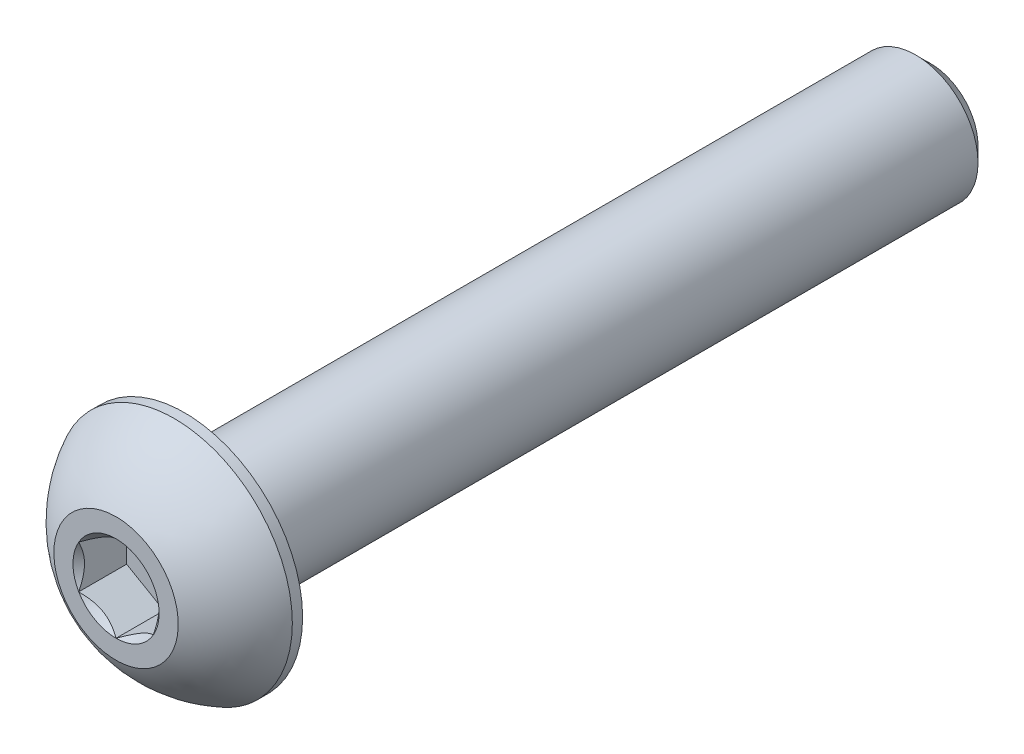
ISO-10303-21;
HEADER;
FILE_DESCRIPTION(('STEP AP214'),'2;1');
FILE_NAME('part.step','',(''),(''),'','','');
FILE_SCHEMA(('AUTOMOTIVE_DESIGN { 1 0 10303 214 1 1 1 1 }'));
ENDSEC;
DATA;
#1=APPLICATION_CONTEXT('core data for automotive mechanical design processes');
#2=APPLICATION_PROTOCOL_DEFINITION('international standard','automotive_design',2000,#1);
#3=PRODUCT_CONTEXT('',#1,'mechanical');
#4=PRODUCT('Part','Part','',(#3));
#5=PRODUCT_RELATED_PRODUCT_CATEGORY('part','',(#4));
#6=PRODUCT_DEFINITION_FORMATION('','',#4);
#7=PRODUCT_DEFINITION_CONTEXT('part definition',#1,'design');
#8=PRODUCT_DEFINITION('design','',#6,#7);
#9=PRODUCT_DEFINITION_SHAPE('','',#8);
#10=(LENGTH_UNIT() NAMED_UNIT(*) SI_UNIT(.MILLI.,.METRE.));
#11=(NAMED_UNIT(*) PLANE_ANGLE_UNIT() SI_UNIT($,.RADIAN.));
#12=(NAMED_UNIT(*) SI_UNIT($,.STERADIAN.) SOLID_ANGLE_UNIT());
#13=UNCERTAINTY_MEASURE_WITH_UNIT(LENGTH_MEASURE(1.E-05),#10,'distance_accuracy_value','');
#14=(GEOMETRIC_REPRESENTATION_CONTEXT(3) GLOBAL_UNCERTAINTY_ASSIGNED_CONTEXT((#13)) GLOBAL_UNIT_ASSIGNED_CONTEXT((#10,
#11,#12)) REPRESENTATION_CONTEXT('',''));
#15=CARTESIAN_POINT('',(0.,0.,0.));
#16=DIRECTION('',(0.,0.,1.));
#17=DIRECTION('',(1.,0.,0.));
#18=AXIS2_PLACEMENT_3D('',#15,#16,#17);
#19=CARTESIAN_POINT('',(1.5,-0.866025403784438,-1.925));
#20=DIRECTION('',(0.,0.,1.));
#21=DIRECTION('',(1.,0.,0.));
#22=AXIS2_PLACEMENT_3D('',#19,#20,#21);
#23=PLANE('',#22);
#24=DIRECTION('',(0.,-1.,0.));
#25=VECTOR('',#24,1.);
#26=CARTESIAN_POINT('',(-1.5,0.866025403784438,-1.925));
#27=LINE('',#26,#25);
#28=CARTESIAN_POINT('',(-1.5,0.866025403784439,-1.925));
#29=VERTEX_POINT('',#28);
#30=CARTESIAN_POINT('',(-1.5,-0.866025403784439,-1.925));
#31=VERTEX_POINT('',#30);
#32=EDGE_CURVE('E67',#29,#31,#27,.T.);
#33=ORIENTED_EDGE('',*,*,#32,.T.);
#34=DIRECTION('',(0.866025403784439,-0.5,0.));
#35=VECTOR('',#34,1.);
#36=CARTESIAN_POINT('',(-1.5,-0.866025403784439,-1.925));
#37=LINE('',#36,#35);
#38=CARTESIAN_POINT('',(0.,-1.73205080756888,-1.925));
#39=VERTEX_POINT('',#38);
#40=EDGE_CURVE('E81',#31,#39,#37,.T.);
#41=ORIENTED_EDGE('',*,*,#40,.T.);
#42=DIRECTION('',(0.866025403784438,0.5,0.));
#43=VECTOR('',#42,1.);
#44=CARTESIAN_POINT('',(0.,-1.73205080756888,-1.925));
#45=LINE('',#44,#43);
#46=CARTESIAN_POINT('',(1.5,-0.86602540378444,-1.925));
#47=VERTEX_POINT('',#46);
#48=EDGE_CURVE('E84',#39,#47,#45,.T.);
#49=ORIENTED_EDGE('',*,*,#48,.T.);
#50=DIRECTION('',(0.,1.,0.));
#51=VECTOR('',#50,1.);
#52=CARTESIAN_POINT('',(1.5,-0.866025403784438,-1.925));
#53=LINE('',#52,#51);
#54=CARTESIAN_POINT('',(1.5,0.866025403784439,-1.925));
#55=VERTEX_POINT('',#54);
#56=EDGE_CURVE('E93',#47,#55,#53,.T.);
#57=ORIENTED_EDGE('',*,*,#56,.T.);
#58=DIRECTION('',(-0.866025403784439,0.5,0.));
#59=VECTOR('',#58,1.);
#60=CARTESIAN_POINT('',(1.5,0.866025403784439,-1.925));
#61=LINE('',#60,#59);
#62=CARTESIAN_POINT('',(0.,1.73205080756888,-1.925));
#63=VERTEX_POINT('',#62);
#64=EDGE_CURVE('E387',#55,#63,#61,.T.);
#65=ORIENTED_EDGE('',*,*,#64,.T.);
#66=DIRECTION('',(-0.866025403784438,-0.5,0.));
#67=VECTOR('',#66,1.);
#68=CARTESIAN_POINT('',(0.,1.73205080756888,-1.925));
#69=LINE('',#68,#67);
#70=EDGE_CURVE('E72',#63,#29,#69,.T.);
#71=ORIENTED_EDGE('',*,*,#70,.T.);
#72=EDGE_LOOP('',(#33,#41,#49,#57,#65,#71));
#73=FACE_BOUND('',#72,.T.);
#74=ADVANCED_FACE('F17',(#73),#23,.T.);
#75=CARTESIAN_POINT('',(-1.5,-0.866025403784439,-1.925));
#76=DIRECTION('',(-0.5,-0.866025403784439,0.));
#77=DIRECTION('',(0.866025403784439,-0.5,0.));
#78=AXIS2_PLACEMENT_3D('',#75,#76,#77);
#79=PLANE('',#78);
#80=CARTESIAN_POINT('',(-1.50000000002453,-0.866025403770049,-3.49737783956075E-11));
#81=CARTESIAN_POINT('',(-1.44844426727117,-0.895791119953617,-0.0297371504849998));
#82=CARTESIAN_POINT('',(-1.39602652187328,-0.926054519369462,-0.05772749973321));
#83=CARTESIAN_POINT('',(-1.28914135977816,-0.987764696477501,-0.108976634295228));
#84=CARTESIAN_POINT('',(-1.23466378385068,-1.01921733960401,-0.132206913925155));
#85=CARTESIAN_POINT('',(-1.12481242363947,-1.08264005199279,-0.172000539063643));
#86=CARTESIAN_POINT('',(-1.06946660011449,-1.11459397810346,-0.188663877355987));
#87=CARTESIAN_POINT('',(-0.95755685533188,-1.17920509937865,-0.214336924391903));
#88=CARTESIAN_POINT('',(-0.900996350293105,-1.21186032218828,-0.223365789908325));
#89=CARTESIAN_POINT('',(-0.803509072843295,-1.26814462806649,-0.231512589340654));
#90=CARTESIAN_POINT('',(-0.762708138141556,-1.29170105869973,-0.232718117543908));
#91=CARTESIAN_POINT('',(-0.68117834074718,-1.33877230917235,-0.230683861819339));
#92=CARTESIAN_POINT('',(-0.640449495964758,-1.36228711867126,-0.22744309593466));
#93=CARTESIAN_POINT('',(-0.559384065201953,-1.40909026694414,-0.216702694706976));
#94=CARTESIAN_POINT('',(-0.519047879504411,-1.4323783746147,-0.20919909909419));
#95=CARTESIAN_POINT('',(-0.439052551258333,-1.47856369891149,-0.19034052638936));
#96=CARTESIAN_POINT('',(-0.399393706909127,-1.50146074337225,-0.178983896683506));
#97=CARTESIAN_POINT('',(-0.297850129661508,-1.56008695503064,-0.145281418581616));
#98=CARTESIAN_POINT('',(-0.236594120185608,-1.59545312859103,-0.120399016466317));
#99=CARTESIAN_POINT('',(-0.146523888893023,-1.64745520087378,-0.0783962697862533));
#100=CARTESIAN_POINT('',(-0.116842951449675,-1.6645914980965,-0.0636393457173693));
#101=CARTESIAN_POINT('',(-0.058026631022432,-1.69854911652791,-0.0327784720806822));
#102=CARTESIAN_POINT('',(-0.0288909964375007,-1.71537058299853,-0.0166751634684281));
#103=CARTESIAN_POINT('',(2.46569689539214E-11,-1.73205080758311,-3.50665873931199E-11));
#104=B_SPLINE_CURVE_WITH_KNOTS('',3,(#80,#81,#82,#83,#84,#85,#86,#87,#88,#89,#90,#91,#92,#93,
#94,#95,#96,#97,#98,#99,#100,#101,#102,#103),.UNSPECIFIED.,.F.,.F.,(4,2,2,2,2,2,2,2,2,2,2,4),
(0.,0.199774419910088,0.400712312277699,0.598459990337993,0.795709985707601,0.936894690871222,
1.07811058146816,1.21945788001607,1.36086588096647,1.58533909988034,1.69726364731887,
1.80913521242832),.UNSPECIFIED.);
#105=CARTESIAN_POINT('',(-1.50000000002135,-0.866025403796765,-2.4650955516094E-11));
#106=VERTEX_POINT('',#105);
#107=CARTESIAN_POINT('',(-3.03586137356069E-11,-1.73205080760065,-1.75293180706268E-11));
#108=VERTEX_POINT('',#107);
#109=EDGE_CURVE('E20',#106,#108,#104,.T.);
#110=ORIENTED_EDGE('',*,*,#109,.T.);
#111=DIRECTION('',(0.,0.,1.));
#112=VECTOR('',#111,1.);
#113=CARTESIAN_POINT('',(0.,-1.73205080756888,-1.925));
#114=LINE('',#113,#112);
#115=EDGE_CURVE('E88',#108,#39,#114,.F.);
#116=ORIENTED_EDGE('',*,*,#115,.T.);
#117=ORIENTED_EDGE('',*,*,#40,.F.);
#118=DIRECTION('',(0.,0.,1.));
#119=VECTOR('',#118,1.);
#120=CARTESIAN_POINT('',(-1.5,-0.866025403784439,-1.925));
#121=LINE('',#120,#119);
#122=EDGE_CURVE('E59',#31,#106,#121,.T.);
#123=ORIENTED_EDGE('',*,*,#122,.T.);
#124=EDGE_LOOP('',(#110,#116,#117,#123));
#125=FACE_BOUND('',#124,.T.);
#126=ADVANCED_FACE('F89',(#125),#79,.F.);
#127=CARTESIAN_POINT('',(0.,-1.73205080756888,-1.925));
#128=DIRECTION('',(0.5,-0.866025403784438,0.));
#129=DIRECTION('',(0.866025403784438,0.5,0.));
#130=AXIS2_PLACEMENT_3D('',#127,#128,#129);
#131=PLANE('',#130);
#132=CARTESIAN_POINT('',(-2.4727404427812E-11,-1.73205080758293,-3.49716199394019E-11));
#133=CARTESIAN_POINT('',(0.0515557327287643,-1.70228509139958,-0.0297371504849976));
#134=CARTESIAN_POINT('',(0.103973478126705,-1.67202169198382,-0.0577274997332079));
#135=CARTESIAN_POINT('',(0.210858640221864,-1.61031151487585,-0.108976634295226));
#136=CARTESIAN_POINT('',(0.26533621614933,-1.57885887174931,-0.132206913925153));
#137=CARTESIAN_POINT('',(0.375187576360525,-1.51543615936052,-0.172000539063641));
#138=CARTESIAN_POINT('',(0.430533399885509,-1.48348223324986,-0.188663877355985));
#139=CARTESIAN_POINT('',(0.542443144668123,-1.41887111197467,-0.214336924391901));
#140=CARTESIAN_POINT('',(0.599003649706897,-1.38621588916504,-0.223365789908323));
#141=CARTESIAN_POINT('',(0.696490927156707,-1.32993158328682,-0.231512589340651));
#142=CARTESIAN_POINT('',(0.737291861858446,-1.30637515265359,-0.232718117543906));
#143=CARTESIAN_POINT('',(0.818821659252822,-1.25930390218097,-0.230683861819337));
#144=CARTESIAN_POINT('',(0.859550504035244,-1.23578909268205,-0.227443095934657));
#145=CARTESIAN_POINT('',(0.940615934798049,-1.18898594440918,-0.216702694706973));
#146=CARTESIAN_POINT('',(0.980952120495592,-1.16569783673862,-0.209199099094188));
#147=CARTESIAN_POINT('',(1.06094744874167,-1.11951251244183,-0.190340526389357));
#148=CARTESIAN_POINT('',(1.10060629309088,-1.09661546798107,-0.178983896683504));
#149=CARTESIAN_POINT('',(1.20214987033849,-1.03798925632268,-0.145281418581613));
#150=CARTESIAN_POINT('',(1.26340587981439,-1.00262308276228,-0.120399016466315));
#151=CARTESIAN_POINT('',(1.35347611110698,-0.950621010479539,-0.0783962697862517));
#152=CARTESIAN_POINT('',(1.38315704855033,-0.933484713256821,-0.063639345717368));
#153=CARTESIAN_POINT('',(1.44197336897757,-0.89952709482541,-0.0327784720806814));
#154=CARTESIAN_POINT('',(1.4711090035625,-0.882705628354789,-0.0166751634684275));
#155=CARTESIAN_POINT('',(1.50000000002466,-0.866025403770207,-3.5066233129564E-11));
#156=B_SPLINE_CURVE_WITH_KNOTS('',3,(#132,#133,#134,#135,#136,#137,#138,#139,#140,#141,#142,
#143,#144,#145,#146,#147,#148,#149,#150,#151,#152,#153,#154,#155),.UNSPECIFIED.,.F.,.F.,(4,2,2,
2,2,2,2,2,2,2,2,4),(0.,0.199774419910088,0.400712312277699,0.598459990337993,0.795709985707601,
0.936894690871222,1.07811058146816,1.21945788001607,1.36086588096647,1.58533909988034,
1.69726364731887,1.80913521242832),.UNSPECIFIED.);
#157=CARTESIAN_POINT('',(1.50000000001233,-0.866025403826621,-1.75289960884086E-11));
#158=VERTEX_POINT('',#157);
#159=EDGE_CURVE('E204',#108,#158,#156,.T.);
#160=ORIENTED_EDGE('',*,*,#159,.T.);
#161=DIRECTION('',(0.,0.,-1.));
#162=VECTOR('',#161,1.);
#163=CARTESIAN_POINT('',(1.5,-0.866025403784439,-1.925));
#164=LINE('',#163,#162);
#165=EDGE_CURVE('E97',#158,#47,#164,.T.);
#166=ORIENTED_EDGE('',*,*,#165,.T.);
#167=ORIENTED_EDGE('',*,*,#48,.F.);
#168=ORIENTED_EDGE('',*,*,#115,.F.);
#169=EDGE_LOOP('',(#160,#166,#167,#168));
#170=FACE_BOUND('',#169,.T.);
#171=ADVANCED_FACE('F95',(#170),#131,.F.);
#172=CARTESIAN_POINT('',(1.5,-0.866025403784438,-1.925));
#173=DIRECTION('',(1.,0.,0.));
#174=DIRECTION('',(0.,0.,-1.));
#175=AXIS2_PLACEMENT_3D('',#172,#173,#174);
#176=PLANE('',#175);
#177=CARTESIAN_POINT('',(1.4999999999998,-0.866025403812882,-3.49731948477309E-11));
#178=CARTESIAN_POINT('',(1.49999999999993,-0.806493971458482,-0.0297371504859724));
#179=CARTESIAN_POINT('',(1.49999999999998,-0.745967172639481,-0.0577274997356717));
#180=CARTESIAN_POINT('',(1.50000000000002,-0.622546818448653,-0.108976634302055));
#181=CARTESIAN_POINT('',(1.50000000000001,-0.559641532208188,-0.132206913934863));
#182=CARTESIAN_POINT('',(1.5,-0.432796107455125,-0.172000539080811));
#183=CARTESIAN_POINT('',(1.5,-0.368888255245699,-0.188663877377684));
#184=CARTESIAN_POINT('',(1.5,-0.239666012718551,-0.214336924424236));
#185=CARTESIAN_POINT('',(1.5,-0.174355567110583,-0.223365789946761));
#186=CARTESIAN_POINT('',(1.5,-0.0617869553803685,-0.231512589389946));
#187=CARTESIAN_POINT('',(1.5,-0.0146740941290635,-0.232718117598397));
#188=CARTESIAN_POINT('',(1.5,0.0794684067864022,-0.230683861885897));
#189=CARTESIAN_POINT('',(1.5,0.126498025769628,-0.227443096008093));
#190=CARTESIAN_POINT('',(1.5,0.220104322286849,-0.216702694795371));
#191=CARTESIAN_POINT('',(1.5,0.266680537614033,-0.209199099190673));
#192=CARTESIAN_POINT('',(1.5,0.359051186180353,-0.190340526502742));
#193=CARTESIAN_POINT('',(1.5,0.404845275088565,-0.178983896805698));
#194=CARTESIAN_POINT('',(1.5,0.522097698449398,-0.145281418704612));
#195=CARTESIAN_POINT('',(1.5,0.592830045625335,-0.120399016572433));
#196=CARTESIAN_POINT('',(1.5,0.69683419026976,-0.0783962698582895));
#197=CARTESIAN_POINT('',(1.5,0.731106784740956,-0.0636393457765502));
#198=CARTESIAN_POINT('',(1.5,0.799022021654026,-0.0327784721118594));
#199=CARTESIAN_POINT('',(1.5,0.832664954619755,-0.0166751634844621));
#200=CARTESIAN_POINT('',(1.5,0.866025403812908,-3.50673015597961E-11));
#201=B_SPLINE_CURVE_WITH_KNOTS('',3,(#177,#178,#179,#180,#181,#182,#183,#184,#185,#186,#187,
#188,#189,#190,#191,#192,#193,#194,#195,#196,#197,#198,#199,#200),.UNSPECIFIED.,.F.,.F.,(4,2,2,
2,2,2,2,2,2,2,2,4),(0.,0.199774419877746,0.400712312213007,0.598459990242251,0.795709985580833,
0.936894690699464,1.07811058125136,1.21945787975417,1.36086588065946,1.58533909974464,
1.69726364726936,1.80913521246463),.UNSPECIFIED.);
#202=CARTESIAN_POINT('',(1.5000000000427,0.866025403774031,-1.75296333077756E-11));
#203=VERTEX_POINT('',#202);
#204=EDGE_CURVE('E186',#158,#203,#201,.T.);
#205=ORIENTED_EDGE('',*,*,#204,.T.);
#206=DIRECTION('',(0.,0.,1.));
#207=VECTOR('',#206,1.);
#208=CARTESIAN_POINT('',(1.5,0.866025403784439,-1.925));
#209=LINE('',#208,#207);
#210=EDGE_CURVE('E380',#203,#55,#209,.F.);
#211=ORIENTED_EDGE('',*,*,#210,.T.);
#212=ORIENTED_EDGE('',*,*,#56,.F.);
#213=ORIENTED_EDGE('',*,*,#165,.F.);
#214=EDGE_LOOP('',(#205,#211,#212,#213));
#215=FACE_BOUND('',#214,.T.);
#216=ADVANCED_FACE('F176',(#215),#176,.F.);
#217=CARTESIAN_POINT('',(1.5,0.866025403784439,-1.925));
#218=DIRECTION('',(0.5,0.866025403784439,0.));
#219=DIRECTION('',(-0.866025403784439,0.5,0.));
#220=AXIS2_PLACEMENT_3D('',#217,#218,#219);
#221=PLANE('',#220);
#222=CARTESIAN_POINT('',(1.50000000002453,0.866025403770048,-3.4973253111955E-11));
#223=CARTESIAN_POINT('',(1.44844426727117,0.895791119953617,-0.0297371504849995));
#224=CARTESIAN_POINT('',(1.39602652187328,0.926054519369461,-0.0577274997332099));
#225=CARTESIAN_POINT('',(1.28914135977816,0.987764696477501,-0.108976634295228));
#226=CARTESIAN_POINT('',(1.23466378385068,1.01921733960401,-0.132206913925156));
#227=CARTESIAN_POINT('',(1.12481242363947,1.08264005199279,-0.172000539063644));
#228=CARTESIAN_POINT('',(1.06946660011449,1.11459397810346,-0.188663877355987));
#229=CARTESIAN_POINT('',(0.95755685533188,1.17920509937865,-0.214336924391904));
#230=CARTESIAN_POINT('',(0.900996350293105,1.21186032218828,-0.223365789908325));
#231=CARTESIAN_POINT('',(0.803509072843295,1.26814462806649,-0.231512589340654));
#232=CARTESIAN_POINT('',(0.762708138141556,1.29170105869973,-0.232718117543908));
#233=CARTESIAN_POINT('',(0.68117834074718,1.33877230917235,-0.230683861819339));
#234=CARTESIAN_POINT('',(0.640449495964758,1.36228711867126,-0.22744309593466));
#235=CARTESIAN_POINT('',(0.559384065201953,1.40909026694414,-0.216702694706976));
#236=CARTESIAN_POINT('',(0.51904787950441,1.4323783746147,-0.20919909909419));
#237=CARTESIAN_POINT('',(0.439052551258333,1.47856369891149,-0.19034052638936));
#238=CARTESIAN_POINT('',(0.399393706909126,1.50146074337225,-0.178983896683506));
#239=CARTESIAN_POINT('',(0.297850129661508,1.56008695503064,-0.145281418581616));
#240=CARTESIAN_POINT('',(0.236594120185608,1.59545312859103,-0.120399016466317));
#241=CARTESIAN_POINT('',(0.146523888893023,1.64745520087378,-0.0783962697862533));
#242=CARTESIAN_POINT('',(0.116842951449675,1.6645914980965,-0.0636393457173695));
#243=CARTESIAN_POINT('',(0.0580266310224324,1.69854911652791,-0.0327784720806825));
#244=CARTESIAN_POINT('',(0.0288909964375013,1.71537058299853,-0.0166751634684285));
#245=CARTESIAN_POINT('',(-2.46561764620561E-11,1.73205080758311,-3.50669956446036E-11));
#246=B_SPLINE_CURVE_WITH_KNOTS('',3,(#222,#223,#224,#225,#226,#227,#228,#229,#230,#231,#232,
#233,#234,#235,#236,#237,#238,#239,#240,#241,#242,#243,#244,#245),.UNSPECIFIED.,.F.,.F.,(4,2,2,
2,2,2,2,2,2,2,2,4),(0.,0.199774419910088,0.400712312277699,0.598459990337994,0.795709985707602,
0.936894690871222,1.07811058146816,1.21945788001607,1.36086588096647,1.58533909988034,
1.69726364731887,1.80913521242832),.UNSPECIFIED.);
#247=CARTESIAN_POINT('',(3.03595659452686E-11,1.73205080760065,-1.75295301999691E-11));
#248=VERTEX_POINT('',#247);
#249=EDGE_CURVE('E180',#203,#248,#246,.T.);
#250=ORIENTED_EDGE('',*,*,#249,.T.);
#251=DIRECTION('',(0.,0.,1.));
#252=VECTOR('',#251,1.);
#253=CARTESIAN_POINT('',(0.,1.73205080756888,-1.925));
#254=LINE('',#253,#252);
#255=EDGE_CURVE('E414',#248,#63,#254,.F.);
#256=ORIENTED_EDGE('',*,*,#255,.T.);
#257=ORIENTED_EDGE('',*,*,#64,.F.);
#258=ORIENTED_EDGE('',*,*,#210,.F.);
#259=EDGE_LOOP('',(#250,#256,#257,#258));
#260=FACE_BOUND('',#259,.T.);
#261=ADVANCED_FACE('F172',(#260),#221,.F.);
#262=CARTESIAN_POINT('',(0.,1.73205080756888,-1.925));
#263=DIRECTION('',(-0.5,0.866025403784438,0.));
#264=DIRECTION('',(-0.866025403784438,-0.5,0.));
#265=AXIS2_PLACEMENT_3D('',#262,#263,#264);
#266=PLANE('',#265);
#267=CARTESIAN_POINT('',(2.47285824502275E-11,1.73205080758293,-3.4971456143468E-11));
#268=CARTESIAN_POINT('',(-0.0515557327287631,1.70228509139958,-0.0297371504849978));
#269=CARTESIAN_POINT('',(-0.103973478126704,1.67202169198382,-0.057727499733208));
#270=CARTESIAN_POINT('',(-0.210858640221863,1.61031151487585,-0.108976634295226));
#271=CARTESIAN_POINT('',(-0.265336216149329,1.57885887174931,-0.132206913925153));
#272=CARTESIAN_POINT('',(-0.375187576360524,1.51543615936052,-0.172000539063641));
#273=CARTESIAN_POINT('',(-0.430533399885509,1.48348223324986,-0.188663877355985));
#274=CARTESIAN_POINT('',(-0.542443144668122,1.41887111197467,-0.214336924391902));
#275=CARTESIAN_POINT('',(-0.599003649706897,1.38621588916503,-0.223365789908323));
#276=CARTESIAN_POINT('',(-0.696490927156706,1.32993158328682,-0.231512589340652));
#277=CARTESIAN_POINT('',(-0.737291861858445,1.30637515265359,-0.232718117543906));
#278=CARTESIAN_POINT('',(-0.818821659252821,1.25930390218097,-0.230683861819337));
#279=CARTESIAN_POINT('',(-0.859550504035243,1.23578909268205,-0.227443095934658));
#280=CARTESIAN_POINT('',(-0.940615934798048,1.18898594440918,-0.216702694706974));
#281=CARTESIAN_POINT('',(-0.980952120495591,1.16569783673862,-0.209199099094188));
#282=CARTESIAN_POINT('',(-1.06094744874167,1.11951251244183,-0.190340526389358));
#283=CARTESIAN_POINT('',(-1.10060629309088,1.09661546798107,-0.178983896683504));
#284=CARTESIAN_POINT('',(-1.20214987033849,1.03798925632268,-0.145281418581613));
#285=CARTESIAN_POINT('',(-1.26340587981439,1.00262308276228,-0.120399016466315));
#286=CARTESIAN_POINT('',(-1.35347611110698,0.950621010479538,-0.0783962697862518));
#287=CARTESIAN_POINT('',(-1.38315704855033,0.933484713256821,-0.0636393457173682));
#288=CARTESIAN_POINT('',(-1.44197336897757,0.899527094825409,-0.0327784720806815));
#289=CARTESIAN_POINT('',(-1.4711090035625,0.882705628354789,-0.0166751634684275));
#290=CARTESIAN_POINT('',(-1.50000000002466,0.866025403770206,-3.50659949264669E-11));
#291=B_SPLINE_CURVE_WITH_KNOTS('',3,(#267,#268,#269,#270,#271,#272,#273,#274,#275,#276,#277,
#278,#279,#280,#281,#282,#283,#284,#285,#286,#287,#288,#289,#290),.UNSPECIFIED.,.F.,.F.,(4,2,2,
2,2,2,2,2,2,2,2,4),(0.,0.199774419910088,0.400712312277699,0.598459990337994,0.795709985707602,
0.936894690871222,1.07811058146816,1.21945788001607,1.36086588096647,1.58533909988034,
1.69726364731887,1.80913521242832),.UNSPECIFIED.);
#292=CARTESIAN_POINT('',(-1.50000000001234,0.86602540382662,-1.75291186124796E-11));
#293=VERTEX_POINT('',#292);
#294=EDGE_CURVE('E40',#248,#293,#291,.T.);
#295=ORIENTED_EDGE('',*,*,#294,.T.);
#296=DIRECTION('',(0.,0.,1.));
#297=VECTOR('',#296,1.);
#298=CARTESIAN_POINT('',(-1.5,0.866025403784438,-1.925));
#299=LINE('',#298,#297);
#300=EDGE_CURVE('E405',#293,#29,#299,.F.);
#301=ORIENTED_EDGE('',*,*,#300,.T.);
#302=ORIENTED_EDGE('',*,*,#70,.F.);
#303=ORIENTED_EDGE('',*,*,#255,.F.);
#304=EDGE_LOOP('',(#295,#301,#302,#303));
#305=FACE_BOUND('',#304,.T.);
#306=ADVANCED_FACE('F165',(#305),#266,.F.);
#307=CARTESIAN_POINT('',(-1.5,0.866025403784438,-1.925));
#308=DIRECTION('',(-1.,0.,0.));
#309=DIRECTION('',(0.,-1.,0.));
#310=AXIS2_PLACEMENT_3D('',#307,#308,#309);
#311=PLANE('',#310);
#312=CARTESIAN_POINT('',(-1.4999999999998,0.866025403812881,-3.4973747365913E-11));
#313=CARTESIAN_POINT('',(-1.49999999999993,0.806493971458482,-0.0297371504859728));
#314=CARTESIAN_POINT('',(-1.49999999999998,0.74596717263948,-0.0577274997356719));
#315=CARTESIAN_POINT('',(-1.50000000000002,0.622546818448652,-0.108976634302056));
#316=CARTESIAN_POINT('',(-1.50000000000001,0.559641532208187,-0.132206913934863));
#317=CARTESIAN_POINT('',(-1.5,0.432796107455125,-0.172000539080811));
#318=CARTESIAN_POINT('',(-1.5,0.368888255245698,-0.188663877377684));
#319=CARTESIAN_POINT('',(-1.5,0.239666012718551,-0.214336924424236));
#320=CARTESIAN_POINT('',(-1.5,0.174355567110582,-0.223365789946761));
#321=CARTESIAN_POINT('',(-1.5,0.0617869553803678,-0.231512589389946));
#322=CARTESIAN_POINT('',(-1.5,0.0146740941290628,-0.232718117598397));
#323=CARTESIAN_POINT('',(-1.5,-0.079468406786403,-0.230683861885897));
#324=CARTESIAN_POINT('',(-1.5,-0.126498025769629,-0.227443096008092));
#325=CARTESIAN_POINT('',(-1.5,-0.220104322286849,-0.21670269479537));
#326=CARTESIAN_POINT('',(-1.5,-0.266680537614034,-0.209199099190673));
#327=CARTESIAN_POINT('',(-1.5,-0.359051186180354,-0.190340526502742));
#328=CARTESIAN_POINT('',(-1.5,-0.404845275088565,-0.178983896805698));
#329=CARTESIAN_POINT('',(-1.5,-0.522097698449399,-0.145281418704611));
#330=CARTESIAN_POINT('',(-1.5,-0.592830045625336,-0.120399016572433));
#331=CARTESIAN_POINT('',(-1.5,-0.69683419026976,-0.0783962698582891));
#332=CARTESIAN_POINT('',(-1.5,-0.731106784740957,-0.0636393457765498));
#333=CARTESIAN_POINT('',(-1.5,-0.799022021654027,-0.0327784721118589));
#334=CARTESIAN_POINT('',(-1.5,-0.832664954619756,-0.0166751634844615));
#335=CARTESIAN_POINT('',(-1.5,-0.866025403812909,-3.50666750779327E-11));
#336=B_SPLINE_CURVE_WITH_KNOTS('',3,(#312,#313,#314,#315,#316,#317,#318,#319,#320,#321,#322,
#323,#324,#325,#326,#327,#328,#329,#330,#331,#332,#333,#334,#335),.UNSPECIFIED.,.F.,.F.,(4,2,2,
2,2,2,2,2,2,2,2,4),(0.,0.199774419877746,0.400712312213007,0.59845999024225,0.795709985580832,
0.936894690699464,1.07811058125136,1.21945787975417,1.36086588065945,1.58533909974464,
1.69726364726936,1.80913521246463),.UNSPECIFIED.);
#337=EDGE_CURVE('E145',#293,#106,#336,.T.);
#338=ORIENTED_EDGE('',*,*,#337,.T.);
#339=ORIENTED_EDGE('',*,*,#122,.F.);
#340=ORIENTED_EDGE('',*,*,#32,.F.);
#341=ORIENTED_EDGE('',*,*,#300,.F.);
#342=EDGE_LOOP('',(#338,#339,#340,#341));
#343=FACE_BOUND('',#342,.T.);
#344=ADVANCED_FACE('F161',(#343),#311,.F.);
#345=CARTESIAN_POINT('',(0.,0.,0.));
#346=DIRECTION('',(0.,0.,1.));
#347=DIRECTION('',(1.,0.,0.));
#348=AXIS2_PLACEMENT_3D('',#345,#346,#347);
#349=CONICAL_SURFACE('',#348,1.73205080761818,0.785398163519197);
#350=ORIENTED_EDGE('',*,*,#109,.F.);
#351=CARTESIAN_POINT('',(0.,0.,0.));
#352=DIRECTION('',(0.,0.,1.));
#353=DIRECTION('',(1.,0.,0.));
#354=AXIS2_PLACEMENT_3D('',#351,#352,#353);
#355=CIRCLE('',#354,1.73205080761818);
#356=EDGE_CURVE('E153',#106,#108,#355,.T.);
#357=ORIENTED_EDGE('',*,*,#356,.T.);
#358=EDGE_LOOP('',(#350,#357));
#359=FACE_BOUND('',#358,.T.);
#360=ADVANCED_FACE('F164',(#359),#349,.F.);
#361=CARTESIAN_POINT('',(0.,0.,0.));
#362=DIRECTION('',(0.,0.,1.));
#363=DIRECTION('',(1.,0.,0.));
#364=AXIS2_PLACEMENT_3D('',#361,#362,#363);
#365=CONICAL_SURFACE('',#364,1.73205080761818,0.785398163519197);
#366=ORIENTED_EDGE('',*,*,#159,.F.);
#367=CARTESIAN_POINT('',(0.,0.,0.));
#368=DIRECTION('',(0.,0.,1.));
#369=DIRECTION('',(1.,0.,0.));
#370=AXIS2_PLACEMENT_3D('',#367,#368,#369);
#371=CIRCLE('',#370,1.73205080761818);
#372=EDGE_CURVE('E393',#108,#158,#371,.T.);
#373=ORIENTED_EDGE('',*,*,#372,.T.);
#374=EDGE_LOOP('',(#366,#373));
#375=FACE_BOUND('',#374,.T.);
#376=ADVANCED_FACE('F199',(#375),#365,.F.);
#377=CARTESIAN_POINT('',(0.,0.,0.));
#378=DIRECTION('',(0.,0.,1.));
#379=DIRECTION('',(1.,0.,0.));
#380=AXIS2_PLACEMENT_3D('',#377,#378,#379);
#381=CONICAL_SURFACE('',#380,1.73205080761818,0.785398163397448);
#382=CARTESIAN_POINT('',(0.,0.,0.));
#383=DIRECTION('',(0.,0.,1.));
#384=DIRECTION('',(1.,0.,0.));
#385=AXIS2_PLACEMENT_3D('',#382,#383,#384);
#386=CIRCLE('',#385,1.73205080761818);
#387=EDGE_CURVE('E389',#158,#203,#386,.T.);
#388=ORIENTED_EDGE('',*,*,#387,.T.);
#389=ORIENTED_EDGE('',*,*,#204,.F.);
#390=EDGE_LOOP('',(#388,#389));
#391=FACE_BOUND('',#390,.T.);
#392=ADVANCED_FACE('F195',(#391),#381,.F.);
#393=CARTESIAN_POINT('',(0.,0.,0.));
#394=DIRECTION('',(0.,0.,1.));
#395=DIRECTION('',(1.,0.,0.));
#396=AXIS2_PLACEMENT_3D('',#393,#394,#395);
#397=CONICAL_SURFACE('',#396,1.73205080761818,0.785398163519197);
#398=ORIENTED_EDGE('',*,*,#249,.F.);
#399=CARTESIAN_POINT('',(0.,0.,0.));
#400=DIRECTION('',(0.,0.,1.));
#401=DIRECTION('',(1.,0.,0.));
#402=AXIS2_PLACEMENT_3D('',#399,#400,#401);
#403=CIRCLE('',#402,1.73205080761818);
#404=EDGE_CURVE('E392',#203,#248,#403,.T.);
#405=ORIENTED_EDGE('',*,*,#404,.T.);
#406=EDGE_LOOP('',(#398,#405));
#407=FACE_BOUND('',#406,.T.);
#408=ADVANCED_FACE('F192',(#407),#397,.F.);
#409=CARTESIAN_POINT('',(0.,0.,0.));
#410=DIRECTION('',(0.,0.,1.));
#411=DIRECTION('',(1.,0.,0.));
#412=AXIS2_PLACEMENT_3D('',#409,#410,#411);
#413=CONICAL_SURFACE('',#412,1.73205080761818,0.785398163519197);
#414=ORIENTED_EDGE('',*,*,#294,.F.);
#415=CARTESIAN_POINT('',(0.,0.,0.));
#416=DIRECTION('',(0.,0.,1.));
#417=DIRECTION('',(1.,0.,0.));
#418=AXIS2_PLACEMENT_3D('',#415,#416,#417);
#419=CIRCLE('',#418,1.73205080761818);
#420=EDGE_CURVE('E399',#248,#293,#419,.T.);
#421=ORIENTED_EDGE('',*,*,#420,.T.);
#422=EDGE_LOOP('',(#414,#421));
#423=FACE_BOUND('',#422,.T.);
#424=ADVANCED_FACE('F140',(#423),#413,.F.);
#425=CARTESIAN_POINT('',(0.,0.,0.));
#426=DIRECTION('',(0.,0.,1.));
#427=DIRECTION('',(1.,0.,0.));
#428=AXIS2_PLACEMENT_3D('',#425,#426,#427);
#429=CONICAL_SURFACE('',#428,1.73205080761818,0.785398163397448);
#430=ORIENTED_EDGE('',*,*,#337,.F.);
#431=CARTESIAN_POINT('',(0.,0.,0.));
#432=DIRECTION('',(0.,0.,1.));
#433=DIRECTION('',(1.,0.,0.));
#434=AXIS2_PLACEMENT_3D('',#431,#432,#433);
#435=CIRCLE('',#434,1.73205080761818);
#436=EDGE_CURVE('E125',#293,#106,#435,.T.);
#437=ORIENTED_EDGE('',*,*,#436,.T.);
#438=EDGE_LOOP('',(#430,#437));
#439=FACE_BOUND('',#438,.T.);
#440=ADVANCED_FACE('F135',(#439),#429,.F.);
#441=CARTESIAN_POINT('',(0.,-2.5,0.));
#442=DIRECTION('',(0.,0.,-1.));
#443=DIRECTION('',(-1.,0.,0.));
#444=AXIS2_PLACEMENT_3D('',#441,#442,#443);
#445=PLANE('',#444);
#446=ORIENTED_EDGE('',*,*,#420,.F.);
#447=ORIENTED_EDGE('',*,*,#404,.F.);
#448=ORIENTED_EDGE('',*,*,#387,.F.);
#449=ORIENTED_EDGE('',*,*,#372,.F.);
#450=ORIENTED_EDGE('',*,*,#356,.F.);
#451=ORIENTED_EDGE('',*,*,#436,.F.);
#452=EDGE_LOOP('',(#446,#447,#448,#449,#450,#451));
#453=FACE_BOUND('',#452,.T.);
#454=CARTESIAN_POINT('',(0.,2.5,0.));
#455=CARTESIAN_POINT('',(-0.140426104916171,2.49999377288615,0.));
#456=CARTESIAN_POINT('',(-0.280954031991962,2.48812860484106,3.15786606079497E-13));
#457=CARTESIAN_POINT('',(-0.558139658492382,2.44096074902969,-3.16166902160035E-13));
#458=CARTESIAN_POINT('',(-0.694792493265144,2.40562985309161,-1.1991938830655E-12));
#459=CARTESIAN_POINT('',(-0.960172122561447,2.31253633023374,-1.20166281841789E-12));
#460=CARTESIAN_POINT('',(-1.08890266852496,2.25478441650809,-3.21946211567848E-13));
#461=CARTESIAN_POINT('',(-1.33480476215494,2.11850293856875,3.21866212850881E-13));
#462=CARTESIAN_POINT('',(-1.45197917410753,2.03997854084975,0.));
#463=CARTESIAN_POINT('',(-1.67149637287936,1.86436525899232,0.));
#464=CARTESIAN_POINT('',(-1.77383760642256,1.76727443311113,0.));
#465=CARTESIAN_POINT('',(-1.96077108972063,1.5572853703438,0.));
#466=CARTESIAN_POINT('',(-2.04536264247664,1.44438651299413,0.));
#467=CARTESIAN_POINT('',(-2.19438926048053,1.20599153577205,0.));
#468=CARTESIAN_POINT('',(-2.2588247010994,1.08049565055392,0.));
#469=CARTESIAN_POINT('',(-2.36571190425968,0.820467575206643,0.));
#470=CARTESIAN_POINT('',(-2.40816371100576,0.685935403248266,0.));
#471=CARTESIAN_POINT('',(-2.46987884513361,0.411653235766082,0.));
#472=CARTESIAN_POINT('',(-2.4891421283097,0.271903230295727,0.));
#473=CARTESIAN_POINT('',(-2.50393321907299,-0.00884700938585592,0.));
#474=CARTESIAN_POINT('',(-2.49946106942909,-0.149847241343843,0.));
#475=CARTESIAN_POINT('',(-2.46690834048228,-0.429095661105701,0.));
#476=CARTESIAN_POINT('',(-2.43882775236998,-0.567343847882636,0.));
#477=CARTESIAN_POINT('',(-2.35985521676827,-0.837163810231989,0.));
#478=CARTESIAN_POINT('',(-2.30896324519902,-0.968735578756572,0.));
#479=CARTESIAN_POINT('',(-2.1858126315262,-1.2214675666181,0.));
#480=CARTESIAN_POINT('',(-2.11355399637579,-1.34262778934316,0.));
#481=CARTESIAN_POINT('',(-1.94972129370707,-1.57109730355804,0.));
#482=CARTESIAN_POINT('',(-1.85814723400701,-1.67840660065422,0.));
#483=CARTESIAN_POINT('',(-1.65828316813495,-1.87612814061528,0.));
#484=CARTESIAN_POINT('',(-1.54999315967219,-1.96654038116456,0.));
#485=CARTESIAN_POINT('',(-1.31977122488187,-2.12790126296045,0.));
#486=CARTESIAN_POINT('',(-1.19783929677156,-2.1988499016635,0.));
#487=CARTESIAN_POINT('',(-0.943794829063063,-2.31926953799948,0.));
#488=CARTESIAN_POINT('',(-0.811682289900767,-2.36874053655201,0.));
#489=CARTESIAN_POINT('',(-0.541026888337529,-2.44480055905628,0.));
#490=CARTESIAN_POINT('',(-0.402484026226278,-2.47138958403887,0.));
#491=CARTESIAN_POINT('',(-0.122900797575727,-2.50093087897621,0.));
#492=CARTESIAN_POINT('',(0.018139568963571,-2.50388314893098,3.46961945081868E-13));
#493=CARTESIAN_POINT('',(0.298714091660324,-2.48606712714886,-3.46961960712715E-13));
#494=CARTESIAN_POINT('',(0.438248247749923,-2.46529883434335,-1.29477243391078E-12));
#495=CARTESIAN_POINT('',(0.71184938433979,-2.40063123468837,-1.13730987603765E-12));
#496=CARTESIAN_POINT('',(0.845916364605969,-2.3567319268485,0.));
#497=CARTESIAN_POINT('',(1.10477735834655,-2.24704847617179,0.));
#498=CARTESIAN_POINT('',(1.22957137303277,-2.18126433619494,-1.00916257566668E-12));
#499=CARTESIAN_POINT('',(1.46634390401786,-2.02967864834022,-1.18352788602047E-12));
#500=CARTESIAN_POINT('',(1.57832242207297,-1.94387710320556,-3.16694129312418E-13));
#501=CARTESIAN_POINT('',(1.7862852822064,-1.7546922142879,3.16694257499622E-13));
#502=CARTESIAN_POINT('',(1.8822696178108,-1.6513088633884,0.));
#503=CARTESIAN_POINT('',(2.0555193719421,-1.42989510132749,0.));
#504=CARTESIAN_POINT('',(2.13278478437748,-1.31186468539964,0.));
#505=CARTESIAN_POINT('',(2.2664032406088,-1.06450749101074,0.));
#506=CARTESIAN_POINT('',(2.32275630647994,-0.935180724474358,0.));
#507=CARTESIAN_POINT('',(2.41295047224872,-0.668901974735227,0.));
#508=CARTESIAN_POINT('',(2.4467915805466,-0.531949994377823,0.));
#509=CARTESIAN_POINT('',(2.49100125494042,-0.254308178115883,0.));
#510=CARTESIAN_POINT('',(2.50136977874099,-0.113618335476538,0.));
#511=CARTESIAN_POINT('',(2.49833983643023,0.167504919749228,0.));
#512=CARTESIAN_POINT('',(2.48494141562714,0.307938332823985,0.));
#513=CARTESIAN_POINT('',(2.43475793877014,0.584562794538377,0.));
#514=CARTESIAN_POINT('',(2.39797283569016,0.720753834646849,0.));
#515=CARTESIAN_POINT('',(2.30205936796063,0.985029646530051,0.));
#516=CARTESIAN_POINT('',(2.24293058718862,1.11311426728121,0.));
#517=CARTESIAN_POINT('',(2.10401075902967,1.3575336098139,0.));
#518=CARTESIAN_POINT('',(2.02422052292125,1.47386879269155,0.));
#519=CARTESIAN_POINT('',(1.84625229096995,1.69148114008358,0.));
#520=CARTESIAN_POINT('',(1.74807621990901,1.79275987884253,0.));
#521=CARTESIAN_POINT('',(1.53608575842464,1.97742315380663,0.));
#522=CARTESIAN_POINT('',(1.42226748721669,2.06080323621403,0.));
#523=CARTESIAN_POINT('',(1.18220372565671,2.20730286771332,0.));
#524=CARTESIAN_POINT('',(1.05595232774905,2.27041272419885,0.));
#525=CARTESIAN_POINT('',(0.79474524318476,2.37446817640477,0.));
#526=CARTESIAN_POINT('',(0.659800208998089,2.41544034072841,0.));
#527=CARTESIAN_POINT('',(0.436662637238998,2.46313736176947,0.));
#528=CARTESIAN_POINT('',(0.349919997758221,2.47694359911888,0.));
#529=CARTESIAN_POINT('',(0.175464826042706,2.49537686389633,0.));
#530=CARTESIAN_POINT('',(0.0877522938079665,2.50000389132438,0.));
#531=CARTESIAN_POINT('',(0.,2.5,0.));
#532=B_SPLINE_CURVE_WITH_KNOTS('',3,(#454,#455,#456,#457,#458,#459,#460,#461,#462,#463,#464,
#465,#466,#467,#468,#469,#470,#471,#472,#473,#474,#475,#476,#477,#478,#479,#480,#481,#482,#483,
#484,#485,#486,#487,#488,#489,#490,#491,#492,#493,#494,#495,#496,#497,#498,#499,#500,#501,#502,
#503,#504,#505,#506,#507,#508,#509,#510,#511,#512,#513,#514,#515,#516,#517,#518,#519,#520,#521,
#522,#523,#524,#525,#526,#527,#528,#529,#530,#531),.UNSPECIFIED.,.T.,.F.,(4,2,2,2,2,2,2,2,2,2,2,
2,2,2,2,2,2,2,2,2,2,2,2,2,2,2,2,2,2,2,2,2,2,2,2,2,2,2,4),(0.,0.420958019059748,
0.842422990224611,1.26368682467408,1.68484598149402,2.10604920874208,2.52726897280856,
2.94848089195443,3.36969196412426,3.7909038392729,4.21211495543997,4.63332622878055,
5.05453794675567,5.47574952765963,5.89696093807138,6.31817240620663,6.73938392938708,
7.16059543453285,7.58180692070278,8.00301840687236,8.42422991201778,8.84544143519829,
9.26665290333358,9.68786431374594,10.1090758946506,10.5302876126258,10.9514988859663,
11.3727100021334,11.793921877282,12.2151329494518,12.6363448685977,13.0575646326643,
13.4787678599123,13.8999270167319,14.3211908511815,14.742655822347,15.1636138414069,
15.4266705700074,15.689727298608),.UNSPECIFIED.);
#533=CARTESIAN_POINT('',(0.,2.5,0.));
#534=VERTEX_POINT('',#533);
#535=EDGE_CURVE('E117',#534,#534,#532,.F.);
#536=ORIENTED_EDGE('',*,*,#535,.F.);
#537=EDGE_LOOP('',(#536));
#538=FACE_BOUND('',#537,.T.);
#539=ADVANCED_FACE('F131',(#453,#538),#445,.F.);
#540=CARTESIAN_POINT('',(0.,0.,-4.65805481283422));
#541=DIRECTION('',(0.,-1.,0.));
#542=DIRECTION('',(0.,0.,-1.));
#543=AXIS2_PLACEMENT_3D('',#540,#541,#542);
#544=SPHERICAL_SURFACE('',#543,5.28653711226622);
#545=ORIENTED_EDGE('',*,*,#535,.T.);
#546=EDGE_LOOP('',(#545));
#547=FACE_BOUND('',#546,.T.);
#548=CARTESIAN_POINT('',(0.,0.,-2.3375));
#549=DIRECTION('',(0.,0.,1.));
#550=DIRECTION('',(1.,0.,0.));
#551=AXIS2_PLACEMENT_3D('',#548,#549,#550);
#552=CIRCLE('',#551,4.75);
#553=CARTESIAN_POINT('',(4.75,0.,-2.3375));
#554=VERTEX_POINT('',#553);
#555=EDGE_CURVE('E114',#554,#554,#552,.F.);
#556=ORIENTED_EDGE('',*,*,#555,.F.);
#557=EDGE_LOOP('',(#556));
#558=FACE_BOUND('',#557,.T.);
#559=ADVANCED_FACE('F127',(#547,#558),#544,.T.);
#560=CARTESIAN_POINT('',(0.,0.,0.));
#561=DIRECTION('',(0.,0.,1.));
#562=DIRECTION('',(1.,0.,0.));
#563=AXIS2_PLACEMENT_3D('',#560,#561,#562);
#564=CYLINDRICAL_SURFACE('',#563,4.75);
#565=CARTESIAN_POINT('',(0.,0.,-2.75));
#566=DIRECTION('',(0.,0.,1.));
#567=DIRECTION('',(1.,0.,0.));
#568=AXIS2_PLACEMENT_3D('',#565,#566,#567);
#569=CIRCLE('',#568,4.75);
#570=CARTESIAN_POINT('',(4.75,0.,-2.75));
#571=VERTEX_POINT('',#570);
#572=EDGE_CURVE('E111',#571,#571,#569,.T.);
#573=ORIENTED_EDGE('',*,*,#572,.T.);
#574=EDGE_LOOP('',(#573));
#575=FACE_BOUND('',#574,.T.);
#576=ORIENTED_EDGE('',*,*,#555,.T.);
#577=EDGE_LOOP('',(#576));
#578=FACE_BOUND('',#577,.T.);
#579=ADVANCED_FACE('F235',(#575,#578),#564,.T.);
#580=CARTESIAN_POINT('',(0.,-2.5,-32.75));
#581=DIRECTION('',(0.,0.,-1.));
#582=DIRECTION('',(0.,1.,0.));
#583=AXIS2_PLACEMENT_3D('',#580,#581,#582);
#584=PLANE('',#583);
#585=CARTESIAN_POINT('',(0.,0.,-32.7499999999645));
#586=DIRECTION('',(0.,0.,1.));
#587=DIRECTION('',(1.,0.,0.));
#588=AXIS2_PLACEMENT_3D('',#585,#586,#587);
#589=CIRCLE('',#588,1.89999999997781);
#590=CARTESIAN_POINT('',(1.89999999997781,0.,-32.7499999999645));
#591=VERTEX_POINT('',#590);
#592=EDGE_CURVE('E108',#591,#591,#589,.T.);
#593=ORIENTED_EDGE('',*,*,#592,.F.);
#594=EDGE_LOOP('',(#593));
#595=FACE_BOUND('',#594,.T.);
#596=ADVANCED_FACE('F232',(#595),#584,.T.);
#597=CARTESIAN_POINT('',(0.,-4.75,-2.75));
#598=DIRECTION('',(0.,0.,1.));
#599=DIRECTION('',(1.,0.,0.));
#600=AXIS2_PLACEMENT_3D('',#597,#598,#599);
#601=PLANE('',#600);
#602=CARTESIAN_POINT('',(0.,0.,-2.75));
#603=DIRECTION('',(0.,0.,1.));
#604=DIRECTION('',(0.,-1.,0.));
#605=AXIS2_PLACEMENT_3D('',#602,#603,#604);
#606=CIRCLE('',#605,2.5);
#607=CARTESIAN_POINT('',(0.,-2.50000000000001,-2.75));
#608=VERTEX_POINT('',#607);
#609=EDGE_CURVE('E31',#608,#608,#606,.F.);
#610=ORIENTED_EDGE('',*,*,#609,.F.);
#611=EDGE_LOOP('',(#610));
#612=FACE_BOUND('',#611,.T.);
#613=ORIENTED_EDGE('',*,*,#572,.F.);
#614=EDGE_LOOP('',(#613));
#615=FACE_BOUND('',#614,.T.);
#616=ADVANCED_FACE('F225',(#612,#615),#601,.F.);
#617=CARTESIAN_POINT('',(0.,0.,-32.1500000000583));
#618=DIRECTION('',(0.,0.,1.));
#619=DIRECTION('',(1.,0.,0.));
#620=AXIS2_PLACEMENT_3D('',#617,#618,#619);
#621=CONICAL_SURFACE('',#620,2.4999999998272,0.785398163350079);
#622=ORIENTED_EDGE('',*,*,#592,.T.);
#623=EDGE_LOOP('',(#622));
#624=FACE_BOUND('',#623,.T.);
#625=CARTESIAN_POINT('',(0.,0.,-32.15));
#626=DIRECTION('',(0.,0.,1.));
#627=DIRECTION('',(0.,-1.,0.));
#628=AXIS2_PLACEMENT_3D('',#625,#626,#627);
#629=CIRCLE('',#628,2.5);
#630=CARTESIAN_POINT('',(0.,-2.5,-32.15));
#631=VERTEX_POINT('',#630);
#632=EDGE_CURVE('E11',#631,#631,#629,.T.);
#633=ORIENTED_EDGE('',*,*,#632,.F.);
#634=EDGE_LOOP('',(#633));
#635=FACE_BOUND('',#634,.T.);
#636=ADVANCED_FACE('F219',(#624,#635),#621,.T.);
#637=CARTESIAN_POINT('',(0.,0.,-32.75));
#638=DIRECTION('',(0.,0.,1.));
#639=DIRECTION('',(0.,-1.,0.));
#640=AXIS2_PLACEMENT_3D('',#637,#638,#639);
#641=CYLINDRICAL_SURFACE('',#640,2.5);
#642=ORIENTED_EDGE('',*,*,#632,.T.);
#643=EDGE_LOOP('',(#642));
#644=FACE_BOUND('',#643,.T.);
#645=ORIENTED_EDGE('',*,*,#609,.T.);
#646=EDGE_LOOP('',(#645));
#647=FACE_BOUND('',#646,.T.);
#648=ADVANCED_FACE('F217',(#644,#647),#641,.T.);
#649=CLOSED_SHELL('',(#74,#126,#171,#216,#261,#306,#344,#360,#376,#392,#408,#424,#440,#539,#559,
#579,#596,#616,#636,#648));
#650=MANIFOLD_SOLID_BREP('B1',#649);
#651=ADVANCED_BREP_SHAPE_REPRESENTATION('',(#18,#650),#14);
#652=SHAPE_DEFINITION_REPRESENTATION(#9,#651);
ENDSEC;
END-ISO-10303-21;
